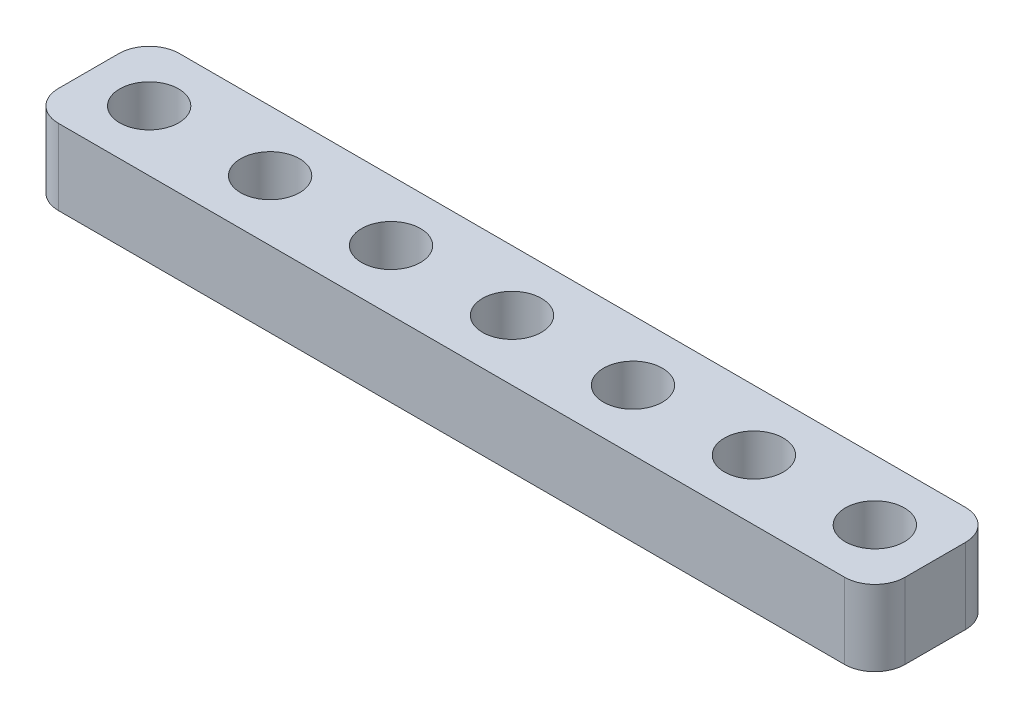
ISO-10303-21;
HEADER;
FILE_DESCRIPTION(('STEP AP214'),'2;1');
FILE_NAME('part.step','',(''),(''),'','','');
FILE_SCHEMA(('AUTOMOTIVE_DESIGN { 1 0 10303 214 1 1 1 1 }'));
ENDSEC;
DATA;
#1=APPLICATION_CONTEXT('core data for automotive mechanical design processes');
#2=APPLICATION_PROTOCOL_DEFINITION('international standard','automotive_design',2000,#1);
#3=PRODUCT_CONTEXT('',#1,'mechanical');
#4=PRODUCT('Part','Part','',(#3));
#5=PRODUCT_RELATED_PRODUCT_CATEGORY('part','',(#4));
#6=PRODUCT_DEFINITION_FORMATION('','',#4);
#7=PRODUCT_DEFINITION_CONTEXT('part definition',#1,'design');
#8=PRODUCT_DEFINITION('design','',#6,#7);
#9=PRODUCT_DEFINITION_SHAPE('','',#8);
#10=(LENGTH_UNIT() NAMED_UNIT(*) SI_UNIT(.MILLI.,.METRE.));
#11=(NAMED_UNIT(*) PLANE_ANGLE_UNIT() SI_UNIT($,.RADIAN.));
#12=(NAMED_UNIT(*) SI_UNIT($,.STERADIAN.) SOLID_ANGLE_UNIT());
#13=UNCERTAINTY_MEASURE_WITH_UNIT(LENGTH_MEASURE(1.E-05),#10,'distance_accuracy_value','');
#14=(GEOMETRIC_REPRESENTATION_CONTEXT(3) GLOBAL_UNCERTAINTY_ASSIGNED_CONTEXT((#13)) GLOBAL_UNIT_ASSIGNED_CONTEXT((#10,
#11,#12)) REPRESENTATION_CONTEXT('',''));
#15=CARTESIAN_POINT('',(0.,0.,0.));
#16=DIRECTION('',(0.,0.,1.));
#17=DIRECTION('',(1.,0.,0.));
#18=AXIS2_PLACEMENT_3D('',#15,#16,#17);
#19=CARTESIAN_POINT('',(54.,5.,6.));
#20=DIRECTION('',(0.,-1.,0.));
#21=DIRECTION('',(0.,0.,-1.));
#22=AXIS2_PLACEMENT_3D('',#19,#20,#21);
#23=CYLINDRICAL_SURFACE('',#22,2.);
#24=CARTESIAN_POINT('',(54.,0.,6.));
#25=DIRECTION('',(0.,1.,0.));
#26=DIRECTION('',(0.,0.,1.));
#27=AXIS2_PLACEMENT_3D('',#24,#25,#26);
#28=CIRCLE('',#27,2.);
#29=CARTESIAN_POINT('',(54.,0.,8.));
#30=VERTEX_POINT('',#29);
#31=CARTESIAN_POINT('',(56.,0.,6.));
#32=VERTEX_POINT('',#31);
#33=EDGE_CURVE('E133',#30,#32,#28,.T.);
#34=ORIENTED_EDGE('',*,*,#33,.T.);
#35=DIRECTION('',(0.,-1.,0.));
#36=VECTOR('',#35,1.);
#37=CARTESIAN_POINT('',(56.,5.,6.));
#38=LINE('',#37,#36);
#39=CARTESIAN_POINT('',(56.,5.,6.));
#40=VERTEX_POINT('',#39);
#41=EDGE_CURVE('E11',#40,#32,#38,.T.);
#42=ORIENTED_EDGE('',*,*,#41,.F.);
#43=CARTESIAN_POINT('',(54.,5.,6.));
#44=DIRECTION('',(0.,1.,0.));
#45=DIRECTION('',(0.,0.,1.));
#46=AXIS2_PLACEMENT_3D('',#43,#44,#45);
#47=CIRCLE('',#46,2.);
#48=CARTESIAN_POINT('',(54.,5.,8.));
#49=VERTEX_POINT('',#48);
#50=EDGE_CURVE('E148',#49,#40,#47,.T.);
#51=ORIENTED_EDGE('',*,*,#50,.F.);
#52=DIRECTION('',(0.,-1.,0.));
#53=VECTOR('',#52,1.);
#54=CARTESIAN_POINT('',(54.,5.,8.));
#55=LINE('',#54,#53);
#56=EDGE_CURVE('E129',#49,#30,#55,.T.);
#57=ORIENTED_EDGE('',*,*,#56,.T.);
#58=EDGE_LOOP('',(#34,#42,#51,#57));
#59=FACE_BOUND('',#58,.T.);
#60=ADVANCED_FACE('F37',(#59),#23,.T.);
#61=CARTESIAN_POINT('',(56.,5.,2.));
#62=DIRECTION('',(-1.,0.,0.));
#63=DIRECTION('',(0.,0.,1.));
#64=AXIS2_PLACEMENT_3D('',#61,#62,#63);
#65=PLANE('',#64);
#66=DIRECTION('',(0.,0.,-1.));
#67=VECTOR('',#66,1.);
#68=CARTESIAN_POINT('',(56.,0.,2.));
#69=LINE('',#68,#67);
#70=CARTESIAN_POINT('',(56.,0.,2.));
#71=VERTEX_POINT('',#70);
#72=EDGE_CURVE('E136',#32,#71,#69,.T.);
#73=ORIENTED_EDGE('',*,*,#72,.T.);
#74=DIRECTION('',(0.,-1.,0.));
#75=VECTOR('',#74,1.);
#76=CARTESIAN_POINT('',(56.,5.,2.));
#77=LINE('',#76,#75);
#78=CARTESIAN_POINT('',(56.,5.,2.));
#79=VERTEX_POINT('',#78);
#80=EDGE_CURVE('E45',#79,#71,#77,.T.);
#81=ORIENTED_EDGE('',*,*,#80,.F.);
#82=DIRECTION('',(0.,0.,-1.));
#83=VECTOR('',#82,1.);
#84=CARTESIAN_POINT('',(56.,5.,2.));
#85=LINE('',#84,#83);
#86=EDGE_CURVE('E96',#40,#79,#85,.T.);
#87=ORIENTED_EDGE('',*,*,#86,.F.);
#88=ORIENTED_EDGE('',*,*,#41,.T.);
#89=EDGE_LOOP('',(#73,#81,#87,#88));
#90=FACE_BOUND('',#89,.T.);
#91=ADVANCED_FACE('F264',(#90),#65,.F.);
#92=CARTESIAN_POINT('',(54.,5.,2.));
#93=DIRECTION('',(0.,-1.,0.));
#94=DIRECTION('',(0.,0.,-1.));
#95=AXIS2_PLACEMENT_3D('',#92,#93,#94);
#96=CYLINDRICAL_SURFACE('',#95,2.);
#97=CARTESIAN_POINT('',(54.,0.,2.));
#98=DIRECTION('',(0.,1.,0.));
#99=DIRECTION('',(0.,0.,-1.));
#100=AXIS2_PLACEMENT_3D('',#97,#98,#99);
#101=CIRCLE('',#100,2.);
#102=CARTESIAN_POINT('',(54.,0.,0.));
#103=VERTEX_POINT('',#102);
#104=EDGE_CURVE('E139',#71,#103,#101,.T.);
#105=ORIENTED_EDGE('',*,*,#104,.T.);
#106=DIRECTION('',(0.,-1.,0.));
#107=VECTOR('',#106,1.);
#108=CARTESIAN_POINT('',(54.,5.,0.));
#109=LINE('',#108,#107);
#110=CARTESIAN_POINT('',(54.,5.,0.));
#111=VERTEX_POINT('',#110);
#112=EDGE_CURVE('E155',#111,#103,#109,.T.);
#113=ORIENTED_EDGE('',*,*,#112,.F.);
#114=CARTESIAN_POINT('',(54.,5.,2.));
#115=DIRECTION('',(0.,1.,0.));
#116=DIRECTION('',(0.,0.,-1.));
#117=AXIS2_PLACEMENT_3D('',#114,#115,#116);
#118=CIRCLE('',#117,2.);
#119=EDGE_CURVE('E163',#79,#111,#118,.T.);
#120=ORIENTED_EDGE('',*,*,#119,.F.);
#121=ORIENTED_EDGE('',*,*,#80,.T.);
#122=EDGE_LOOP('',(#105,#113,#120,#121));
#123=FACE_BOUND('',#122,.T.);
#124=ADVANCED_FACE('F161',(#123),#96,.T.);
#125=CARTESIAN_POINT('',(2.00000000000001,5.,0.));
#126=DIRECTION('',(0.,0.,1.));
#127=DIRECTION('',(1.,0.,0.));
#128=AXIS2_PLACEMENT_3D('',#125,#126,#127);
#129=PLANE('',#128);
#130=DIRECTION('',(-1.,0.,0.));
#131=VECTOR('',#130,1.);
#132=CARTESIAN_POINT('',(2.00000000000001,0.,0.));
#133=LINE('',#132,#131);
#134=CARTESIAN_POINT('',(2.00000000000001,0.,0.));
#135=VERTEX_POINT('',#134);
#136=EDGE_CURVE('E141',#103,#135,#133,.T.);
#137=ORIENTED_EDGE('',*,*,#136,.T.);
#138=DIRECTION('',(0.,-1.,0.));
#139=VECTOR('',#138,1.);
#140=CARTESIAN_POINT('',(2.00000000000001,5.,0.));
#141=LINE('',#140,#139);
#142=CARTESIAN_POINT('',(2.00000000000001,5.,0.));
#143=VERTEX_POINT('',#142);
#144=EDGE_CURVE('E152',#143,#135,#141,.T.);
#145=ORIENTED_EDGE('',*,*,#144,.F.);
#146=DIRECTION('',(-1.,0.,0.));
#147=VECTOR('',#146,1.);
#148=CARTESIAN_POINT('',(2.00000000000001,5.,0.));
#149=LINE('',#148,#147);
#150=EDGE_CURVE('E175',#111,#143,#149,.T.);
#151=ORIENTED_EDGE('',*,*,#150,.F.);
#152=ORIENTED_EDGE('',*,*,#112,.T.);
#153=EDGE_LOOP('',(#137,#145,#151,#152));
#154=FACE_BOUND('',#153,.T.);
#155=ADVANCED_FACE('F171',(#154),#129,.F.);
#156=CARTESIAN_POINT('',(2.,5.,2.));
#157=DIRECTION('',(0.,-1.,0.));
#158=DIRECTION('',(0.,0.,-1.));
#159=AXIS2_PLACEMENT_3D('',#156,#157,#158);
#160=CYLINDRICAL_SURFACE('',#159,2.);
#161=CARTESIAN_POINT('',(2.,0.,2.));
#162=DIRECTION('',(0.,1.,0.));
#163=DIRECTION('',(0.,0.,1.));
#164=AXIS2_PLACEMENT_3D('',#161,#162,#163);
#165=CIRCLE('',#164,2.);
#166=CARTESIAN_POINT('',(0.,0.,2.00000000000001));
#167=VERTEX_POINT('',#166);
#168=EDGE_CURVE('E143',#135,#167,#165,.T.);
#169=ORIENTED_EDGE('',*,*,#168,.T.);
#170=DIRECTION('',(0.,-1.,0.));
#171=VECTOR('',#170,1.);
#172=CARTESIAN_POINT('',(0.,5.,2.00000000000001));
#173=LINE('',#172,#171);
#174=CARTESIAN_POINT('',(0.,5.,2.00000000000001));
#175=VERTEX_POINT('',#174);
#176=EDGE_CURVE('E124',#175,#167,#173,.T.);
#177=ORIENTED_EDGE('',*,*,#176,.F.);
#178=CARTESIAN_POINT('',(2.,5.,2.));
#179=DIRECTION('',(0.,1.,0.));
#180=DIRECTION('',(0.,0.,1.));
#181=AXIS2_PLACEMENT_3D('',#178,#179,#180);
#182=CIRCLE('',#181,2.);
#183=EDGE_CURVE('E115',#143,#175,#182,.T.);
#184=ORIENTED_EDGE('',*,*,#183,.F.);
#185=ORIENTED_EDGE('',*,*,#144,.T.);
#186=EDGE_LOOP('',(#169,#177,#184,#185));
#187=FACE_BOUND('',#186,.T.);
#188=ADVANCED_FACE('F174',(#187),#160,.T.);
#189=CARTESIAN_POINT('',(0.,5.,2.00000000000001));
#190=DIRECTION('',(1.,0.,0.));
#191=DIRECTION('',(0.,0.,-1.));
#192=AXIS2_PLACEMENT_3D('',#189,#190,#191);
#193=PLANE('',#192);
#194=DIRECTION('',(0.,0.,1.));
#195=VECTOR('',#194,1.);
#196=CARTESIAN_POINT('',(0.,0.,2.00000000000001));
#197=LINE('',#196,#195);
#198=CARTESIAN_POINT('',(0.,0.,6.));
#199=VERTEX_POINT('',#198);
#200=EDGE_CURVE('E123',#167,#199,#197,.T.);
#201=ORIENTED_EDGE('',*,*,#200,.T.);
#202=DIRECTION('',(0.,-1.,0.));
#203=VECTOR('',#202,1.);
#204=CARTESIAN_POINT('',(0.,5.,6.));
#205=LINE('',#204,#203);
#206=CARTESIAN_POINT('',(0.,5.,6.));
#207=VERTEX_POINT('',#206);
#208=EDGE_CURVE('E120',#207,#199,#205,.T.);
#209=ORIENTED_EDGE('',*,*,#208,.F.);
#210=DIRECTION('',(0.,0.,1.));
#211=VECTOR('',#210,1.);
#212=CARTESIAN_POINT('',(0.,5.,2.00000000000001));
#213=LINE('',#212,#211);
#214=EDGE_CURVE('E109',#175,#207,#213,.T.);
#215=ORIENTED_EDGE('',*,*,#214,.F.);
#216=ORIENTED_EDGE('',*,*,#176,.T.);
#217=EDGE_LOOP('',(#201,#209,#215,#216));
#218=FACE_BOUND('',#217,.T.);
#219=ADVANCED_FACE('F121',(#218),#193,.F.);
#220=CARTESIAN_POINT('',(2.,5.,6.));
#221=DIRECTION('',(0.,-1.,0.));
#222=DIRECTION('',(0.,0.,-1.));
#223=AXIS2_PLACEMENT_3D('',#220,#221,#222);
#224=CYLINDRICAL_SURFACE('',#223,2.);
#225=CARTESIAN_POINT('',(2.,0.,6.));
#226=DIRECTION('',(0.,1.,0.));
#227=DIRECTION('',(0.,0.,1.));
#228=AXIS2_PLACEMENT_3D('',#225,#226,#227);
#229=CIRCLE('',#228,2.);
#230=CARTESIAN_POINT('',(2.,0.,8.));
#231=VERTEX_POINT('',#230);
#232=EDGE_CURVE('E82',#199,#231,#229,.T.);
#233=ORIENTED_EDGE('',*,*,#232,.T.);
#234=DIRECTION('',(0.,-1.,0.));
#235=VECTOR('',#234,1.);
#236=CARTESIAN_POINT('',(2.,5.,8.));
#237=LINE('',#236,#235);
#238=CARTESIAN_POINT('',(2.,5.,8.));
#239=VERTEX_POINT('',#238);
#240=EDGE_CURVE('E125',#239,#231,#237,.T.);
#241=ORIENTED_EDGE('',*,*,#240,.F.);
#242=CARTESIAN_POINT('',(2.,5.,6.));
#243=DIRECTION('',(0.,1.,0.));
#244=DIRECTION('',(0.,0.,1.));
#245=AXIS2_PLACEMENT_3D('',#242,#243,#244);
#246=CIRCLE('',#245,2.);
#247=EDGE_CURVE('E113',#207,#239,#246,.T.);
#248=ORIENTED_EDGE('',*,*,#247,.F.);
#249=ORIENTED_EDGE('',*,*,#208,.T.);
#250=EDGE_LOOP('',(#233,#241,#248,#249));
#251=FACE_BOUND('',#250,.T.);
#252=ADVANCED_FACE('F127',(#251),#224,.T.);
#253=CARTESIAN_POINT('',(2.,5.,8.));
#254=DIRECTION('',(0.,0.,-1.));
#255=DIRECTION('',(-1.,0.,0.));
#256=AXIS2_PLACEMENT_3D('',#253,#254,#255);
#257=PLANE('',#256);
#258=DIRECTION('',(1.,0.,0.));
#259=VECTOR('',#258,1.);
#260=CARTESIAN_POINT('',(2.,0.,8.));
#261=LINE('',#260,#259);
#262=EDGE_CURVE('E88',#231,#30,#261,.T.);
#263=ORIENTED_EDGE('',*,*,#262,.T.);
#264=ORIENTED_EDGE('',*,*,#56,.F.);
#265=DIRECTION('',(1.,0.,0.));
#266=VECTOR('',#265,1.);
#267=CARTESIAN_POINT('',(2.,5.,8.));
#268=LINE('',#267,#266);
#269=EDGE_CURVE('E53',#239,#49,#268,.T.);
#270=ORIENTED_EDGE('',*,*,#269,.F.);
#271=ORIENTED_EDGE('',*,*,#240,.T.);
#272=EDGE_LOOP('',(#263,#264,#270,#271));
#273=FACE_BOUND('',#272,.T.);
#274=ADVANCED_FACE('F234',(#273),#257,.F.);
#275=CARTESIAN_POINT('',(54.,5.,6.));
#276=DIRECTION('',(0.,1.,0.));
#277=DIRECTION('',(0.,0.,1.));
#278=AXIS2_PLACEMENT_3D('',#275,#276,#277);
#279=PLANE('',#278);
#280=CARTESIAN_POINT('',(52.,5.,4.));
#281=DIRECTION('',(0.,1.,0.));
#282=DIRECTION('',(0.,0.,1.));
#283=AXIS2_PLACEMENT_3D('',#280,#281,#282);
#284=CIRCLE('',#283,1.95);
#285=CARTESIAN_POINT('',(52.,5.,5.95));
#286=VERTEX_POINT('',#285);
#287=EDGE_CURVE('E188',#286,#286,#284,.T.);
#288=ORIENTED_EDGE('',*,*,#287,.F.);
#289=EDGE_LOOP('',(#288));
#290=FACE_BOUND('',#289,.T.);
#291=CARTESIAN_POINT('',(36.,5.,4.));
#292=DIRECTION('',(0.,1.,0.));
#293=DIRECTION('',(0.,0.,1.));
#294=AXIS2_PLACEMENT_3D('',#291,#292,#293);
#295=CIRCLE('',#294,1.95);
#296=CARTESIAN_POINT('',(36.,5.,5.95));
#297=VERTEX_POINT('',#296);
#298=EDGE_CURVE('E195',#297,#297,#295,.T.);
#299=ORIENTED_EDGE('',*,*,#298,.F.);
#300=EDGE_LOOP('',(#299));
#301=FACE_BOUND('',#300,.T.);
#302=CARTESIAN_POINT('',(28.,5.,4.));
#303=DIRECTION('',(0.,1.,0.));
#304=DIRECTION('',(0.,0.,1.));
#305=AXIS2_PLACEMENT_3D('',#302,#303,#304);
#306=CIRCLE('',#305,1.95000000000001);
#307=CARTESIAN_POINT('',(28.,5.,5.95000000000002));
#308=VERTEX_POINT('',#307);
#309=EDGE_CURVE('E201',#308,#308,#306,.T.);
#310=ORIENTED_EDGE('',*,*,#309,.F.);
#311=EDGE_LOOP('',(#310));
#312=FACE_BOUND('',#311,.T.);
#313=CARTESIAN_POINT('',(20.,5.,4.));
#314=DIRECTION('',(0.,1.,0.));
#315=DIRECTION('',(0.,0.,1.));
#316=AXIS2_PLACEMENT_3D('',#313,#314,#315);
#317=CIRCLE('',#316,1.95);
#318=CARTESIAN_POINT('',(20.,5.,5.95));
#319=VERTEX_POINT('',#318);
#320=EDGE_CURVE('E207',#319,#319,#317,.T.);
#321=ORIENTED_EDGE('',*,*,#320,.F.);
#322=EDGE_LOOP('',(#321));
#323=FACE_BOUND('',#322,.T.);
#324=CARTESIAN_POINT('',(12.,5.,4.00000000000001));
#325=DIRECTION('',(0.,1.,0.));
#326=DIRECTION('',(0.,0.,1.));
#327=AXIS2_PLACEMENT_3D('',#324,#325,#326);
#328=CIRCLE('',#327,1.95);
#329=CARTESIAN_POINT('',(12.,5.,5.95));
#330=VERTEX_POINT('',#329);
#331=EDGE_CURVE('E213',#330,#330,#328,.T.);
#332=ORIENTED_EDGE('',*,*,#331,.F.);
#333=EDGE_LOOP('',(#332));
#334=FACE_BOUND('',#333,.T.);
#335=CARTESIAN_POINT('',(44.,5.,4.));
#336=DIRECTION('',(0.,1.,0.));
#337=DIRECTION('',(0.,0.,1.));
#338=AXIS2_PLACEMENT_3D('',#335,#336,#337);
#339=CIRCLE('',#338,1.95);
#340=CARTESIAN_POINT('',(44.,5.,5.95));
#341=VERTEX_POINT('',#340);
#342=EDGE_CURVE('E181',#341,#341,#339,.T.);
#343=ORIENTED_EDGE('',*,*,#342,.F.);
#344=EDGE_LOOP('',(#343));
#345=FACE_BOUND('',#344,.T.);
#346=CARTESIAN_POINT('',(4.,5.,4.00000000000001));
#347=DIRECTION('',(0.,1.,0.));
#348=DIRECTION('',(0.,0.,1.));
#349=AXIS2_PLACEMENT_3D('',#346,#347,#348);
#350=CIRCLE('',#349,1.95);
#351=CARTESIAN_POINT('',(4.,5.,5.95));
#352=VERTEX_POINT('',#351);
#353=EDGE_CURVE('E189',#352,#352,#350,.T.);
#354=ORIENTED_EDGE('',*,*,#353,.F.);
#355=EDGE_LOOP('',(#354));
#356=FACE_BOUND('',#355,.T.);
#357=ORIENTED_EDGE('',*,*,#50,.T.);
#358=ORIENTED_EDGE('',*,*,#86,.T.);
#359=ORIENTED_EDGE('',*,*,#119,.T.);
#360=ORIENTED_EDGE('',*,*,#150,.T.);
#361=ORIENTED_EDGE('',*,*,#183,.T.);
#362=ORIENTED_EDGE('',*,*,#214,.T.);
#363=ORIENTED_EDGE('',*,*,#247,.T.);
#364=ORIENTED_EDGE('',*,*,#269,.T.);
#365=EDGE_LOOP('',(#357,#358,#359,#360,#361,#362,#363,#364));
#366=FACE_BOUND('',#365,.T.);
#367=ADVANCED_FACE('F111',(#290,#301,#312,#323,#334,#345,#356,#366),#279,.T.);
#368=CARTESIAN_POINT('',(54.,0.,6.));
#369=DIRECTION('',(0.,1.,0.));
#370=DIRECTION('',(0.,0.,1.));
#371=AXIS2_PLACEMENT_3D('',#368,#369,#370);
#372=PLANE('',#371);
#373=CARTESIAN_POINT('',(52.,0.,4.));
#374=DIRECTION('',(0.,1.,0.));
#375=DIRECTION('',(0.,0.,1.));
#376=AXIS2_PLACEMENT_3D('',#373,#374,#375);
#377=CIRCLE('',#376,1.95);
#378=CARTESIAN_POINT('',(52.,0.,5.95));
#379=VERTEX_POINT('',#378);
#380=EDGE_CURVE('E137',#379,#379,#377,.T.);
#381=ORIENTED_EDGE('',*,*,#380,.T.);
#382=EDGE_LOOP('',(#381));
#383=FACE_BOUND('',#382,.T.);
#384=CARTESIAN_POINT('',(36.,0.,4.));
#385=DIRECTION('',(0.,1.,0.));
#386=DIRECTION('',(0.,0.,1.));
#387=AXIS2_PLACEMENT_3D('',#384,#385,#386);
#388=CIRCLE('',#387,1.95);
#389=CARTESIAN_POINT('',(36.,0.,5.95));
#390=VERTEX_POINT('',#389);
#391=EDGE_CURVE('E198',#390,#390,#388,.T.);
#392=ORIENTED_EDGE('',*,*,#391,.T.);
#393=EDGE_LOOP('',(#392));
#394=FACE_BOUND('',#393,.T.);
#395=CARTESIAN_POINT('',(28.,0.,4.));
#396=DIRECTION('',(0.,1.,0.));
#397=DIRECTION('',(0.,0.,1.));
#398=AXIS2_PLACEMENT_3D('',#395,#396,#397);
#399=CIRCLE('',#398,1.95000000000001);
#400=CARTESIAN_POINT('',(28.,0.,5.95000000000002));
#401=VERTEX_POINT('',#400);
#402=EDGE_CURVE('E204',#401,#401,#399,.T.);
#403=ORIENTED_EDGE('',*,*,#402,.T.);
#404=EDGE_LOOP('',(#403));
#405=FACE_BOUND('',#404,.T.);
#406=CARTESIAN_POINT('',(20.,0.,4.));
#407=DIRECTION('',(0.,1.,0.));
#408=DIRECTION('',(0.,0.,1.));
#409=AXIS2_PLACEMENT_3D('',#406,#407,#408);
#410=CIRCLE('',#409,1.95);
#411=CARTESIAN_POINT('',(20.,0.,5.95));
#412=VERTEX_POINT('',#411);
#413=EDGE_CURVE('E210',#412,#412,#410,.T.);
#414=ORIENTED_EDGE('',*,*,#413,.T.);
#415=EDGE_LOOP('',(#414));
#416=FACE_BOUND('',#415,.T.);
#417=CARTESIAN_POINT('',(12.,0.,4.00000000000001));
#418=DIRECTION('',(0.,1.,0.));
#419=DIRECTION('',(0.,0.,1.));
#420=AXIS2_PLACEMENT_3D('',#417,#418,#419);
#421=CIRCLE('',#420,1.95);
#422=CARTESIAN_POINT('',(12.,0.,5.95));
#423=VERTEX_POINT('',#422);
#424=EDGE_CURVE('E192',#423,#423,#421,.T.);
#425=ORIENTED_EDGE('',*,*,#424,.T.);
#426=EDGE_LOOP('',(#425));
#427=FACE_BOUND('',#426,.T.);
#428=CARTESIAN_POINT('',(44.,0.,4.));
#429=DIRECTION('',(0.,1.,0.));
#430=DIRECTION('',(0.,0.,1.));
#431=AXIS2_PLACEMENT_3D('',#428,#429,#430);
#432=CIRCLE('',#431,1.95);
#433=CARTESIAN_POINT('',(44.,0.,5.95));
#434=VERTEX_POINT('',#433);
#435=EDGE_CURVE('E184',#434,#434,#432,.T.);
#436=ORIENTED_EDGE('',*,*,#435,.T.);
#437=EDGE_LOOP('',(#436));
#438=FACE_BOUND('',#437,.T.);
#439=CARTESIAN_POINT('',(4.,0.,4.00000000000001));
#440=DIRECTION('',(0.,1.,0.));
#441=DIRECTION('',(0.,0.,1.));
#442=AXIS2_PLACEMENT_3D('',#439,#440,#441);
#443=CIRCLE('',#442,1.95);
#444=CARTESIAN_POINT('',(4.,0.,5.95));
#445=VERTEX_POINT('',#444);
#446=EDGE_CURVE('E185',#445,#445,#443,.T.);
#447=ORIENTED_EDGE('',*,*,#446,.T.);
#448=EDGE_LOOP('',(#447));
#449=FACE_BOUND('',#448,.T.);
#450=ORIENTED_EDGE('',*,*,#33,.F.);
#451=ORIENTED_EDGE('',*,*,#262,.F.);
#452=ORIENTED_EDGE('',*,*,#232,.F.);
#453=ORIENTED_EDGE('',*,*,#200,.F.);
#454=ORIENTED_EDGE('',*,*,#168,.F.);
#455=ORIENTED_EDGE('',*,*,#136,.F.);
#456=ORIENTED_EDGE('',*,*,#104,.F.);
#457=ORIENTED_EDGE('',*,*,#72,.F.);
#458=EDGE_LOOP('',(#450,#451,#452,#453,#454,#455,#456,#457));
#459=FACE_BOUND('',#458,.T.);
#460=ADVANCED_FACE('F167',(#383,#394,#405,#416,#427,#438,#449,#459),#372,.F.);
#461=CARTESIAN_POINT('',(4.,0.,4.00000000000001));
#462=DIRECTION('',(0.,1.,0.));
#463=DIRECTION('',(0.,0.,1.));
#464=AXIS2_PLACEMENT_3D('',#461,#462,#463);
#465=CYLINDRICAL_SURFACE('',#464,1.95);
#466=ORIENTED_EDGE('',*,*,#446,.F.);
#467=EDGE_LOOP('',(#466));
#468=FACE_BOUND('',#467,.T.);
#469=ORIENTED_EDGE('',*,*,#353,.T.);
#470=EDGE_LOOP('',(#469));
#471=FACE_BOUND('',#470,.T.);
#472=ADVANCED_FACE('F248',(#468,#471),#465,.F.);
#473=CARTESIAN_POINT('',(44.,0.,4.));
#474=DIRECTION('',(0.,1.,0.));
#475=DIRECTION('',(0.,0.,1.));
#476=AXIS2_PLACEMENT_3D('',#473,#474,#475);
#477=CYLINDRICAL_SURFACE('',#476,1.95);
#478=ORIENTED_EDGE('',*,*,#435,.F.);
#479=EDGE_LOOP('',(#478));
#480=FACE_BOUND('',#479,.T.);
#481=ORIENTED_EDGE('',*,*,#342,.T.);
#482=EDGE_LOOP('',(#481));
#483=FACE_BOUND('',#482,.T.);
#484=ADVANCED_FACE('F250',(#480,#483),#477,.F.);
#485=CARTESIAN_POINT('',(12.,0.,4.00000000000001));
#486=DIRECTION('',(0.,1.,0.));
#487=DIRECTION('',(0.,0.,1.));
#488=AXIS2_PLACEMENT_3D('',#485,#486,#487);
#489=CYLINDRICAL_SURFACE('',#488,1.95);
#490=ORIENTED_EDGE('',*,*,#424,.F.);
#491=EDGE_LOOP('',(#490));
#492=FACE_BOUND('',#491,.T.);
#493=ORIENTED_EDGE('',*,*,#331,.T.);
#494=EDGE_LOOP('',(#493));
#495=FACE_BOUND('',#494,.T.);
#496=ADVANCED_FACE('F257',(#492,#495),#489,.F.);
#497=CARTESIAN_POINT('',(20.,0.,4.));
#498=DIRECTION('',(0.,1.,0.));
#499=DIRECTION('',(0.,0.,1.));
#500=AXIS2_PLACEMENT_3D('',#497,#498,#499);
#501=CYLINDRICAL_SURFACE('',#500,1.95);
#502=ORIENTED_EDGE('',*,*,#413,.F.);
#503=EDGE_LOOP('',(#502));
#504=FACE_BOUND('',#503,.T.);
#505=ORIENTED_EDGE('',*,*,#320,.T.);
#506=EDGE_LOOP('',(#505));
#507=FACE_BOUND('',#506,.T.);
#508=ADVANCED_FACE('F340',(#504,#507),#501,.F.);
#509=CARTESIAN_POINT('',(28.,0.,4.));
#510=DIRECTION('',(0.,1.,0.));
#511=DIRECTION('',(0.,0.,1.));
#512=AXIS2_PLACEMENT_3D('',#509,#510,#511);
#513=CYLINDRICAL_SURFACE('',#512,1.95000000000001);
#514=ORIENTED_EDGE('',*,*,#402,.F.);
#515=EDGE_LOOP('',(#514));
#516=FACE_BOUND('',#515,.T.);
#517=ORIENTED_EDGE('',*,*,#309,.T.);
#518=EDGE_LOOP('',(#517));
#519=FACE_BOUND('',#518,.T.);
#520=ADVANCED_FACE('F350',(#516,#519),#513,.F.);
#521=CARTESIAN_POINT('',(36.,0.,4.));
#522=DIRECTION('',(0.,1.,0.));
#523=DIRECTION('',(0.,0.,1.));
#524=AXIS2_PLACEMENT_3D('',#521,#522,#523);
#525=CYLINDRICAL_SURFACE('',#524,1.95);
#526=ORIENTED_EDGE('',*,*,#391,.F.);
#527=EDGE_LOOP('',(#526));
#528=FACE_BOUND('',#527,.T.);
#529=ORIENTED_EDGE('',*,*,#298,.T.);
#530=EDGE_LOOP('',(#529));
#531=FACE_BOUND('',#530,.T.);
#532=ADVANCED_FACE('F228',(#528,#531),#525,.F.);
#533=CARTESIAN_POINT('',(52.,0.,4.));
#534=DIRECTION('',(0.,1.,0.));
#535=DIRECTION('',(0.,0.,1.));
#536=AXIS2_PLACEMENT_3D('',#533,#534,#535);
#537=CYLINDRICAL_SURFACE('',#536,1.95);
#538=ORIENTED_EDGE('',*,*,#380,.F.);
#539=EDGE_LOOP('',(#538));
#540=FACE_BOUND('',#539,.T.);
#541=ORIENTED_EDGE('',*,*,#287,.T.);
#542=EDGE_LOOP('',(#541));
#543=FACE_BOUND('',#542,.T.);
#544=ADVANCED_FACE('F225',(#540,#543),#537,.F.);
#545=CLOSED_SHELL('',(#60,#91,#124,#155,#188,#219,#252,#274,#367,#460,#472,#484,#496,#508,#520,
#532,#544));
#546=MANIFOLD_SOLID_BREP('B2',#545);
#547=ADVANCED_BREP_SHAPE_REPRESENTATION('',(#18,#546),#14);
#548=SHAPE_DEFINITION_REPRESENTATION(#9,#547);
ENDSEC;
END-ISO-10303-21;
